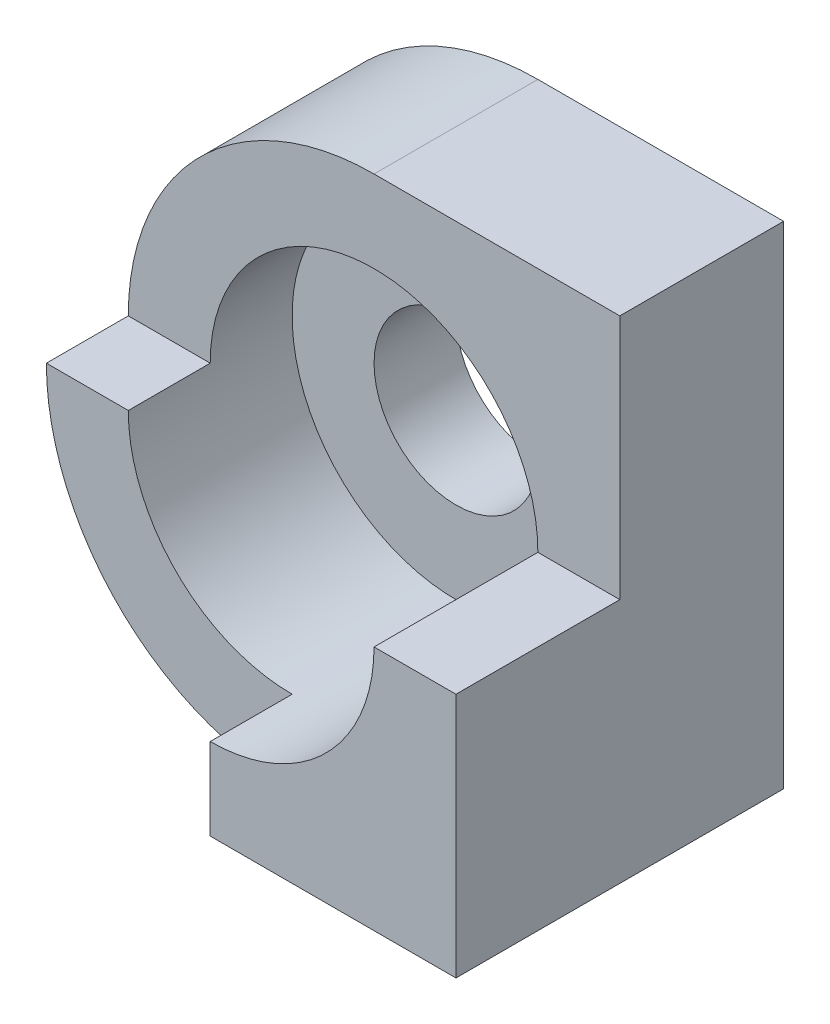
ISO-10303-21;
HEADER;
FILE_DESCRIPTION(('STEP AP214'),'2;1');
FILE_NAME('part.step','',(''),(''),'','','');
FILE_SCHEMA(('AUTOMOTIVE_DESIGN { 1 0 10303 214 1 1 1 1 }'));
ENDSEC;
DATA;
#1=APPLICATION_CONTEXT('core data for automotive mechanical design processes');
#2=APPLICATION_PROTOCOL_DEFINITION('international standard','automotive_design',2000,#1);
#3=PRODUCT_CONTEXT('',#1,'mechanical');
#4=PRODUCT('Part','Part','',(#3));
#5=PRODUCT_RELATED_PRODUCT_CATEGORY('part','',(#4));
#6=PRODUCT_DEFINITION_FORMATION('','',#4);
#7=PRODUCT_DEFINITION_CONTEXT('part definition',#1,'design');
#8=PRODUCT_DEFINITION('design','',#6,#7);
#9=PRODUCT_DEFINITION_SHAPE('','',#8);
#10=(LENGTH_UNIT() NAMED_UNIT(*) SI_UNIT(.MILLI.,.METRE.));
#11=(NAMED_UNIT(*) PLANE_ANGLE_UNIT() SI_UNIT($,.RADIAN.));
#12=(NAMED_UNIT(*) SI_UNIT($,.STERADIAN.) SOLID_ANGLE_UNIT());
#13=UNCERTAINTY_MEASURE_WITH_UNIT(LENGTH_MEASURE(1.E-05),#10,'distance_accuracy_value','');
#14=(GEOMETRIC_REPRESENTATION_CONTEXT(3) GLOBAL_UNCERTAINTY_ASSIGNED_CONTEXT((#13)) GLOBAL_UNIT_ASSIGNED_CONTEXT((#10,
#11,#12)) REPRESENTATION_CONTEXT('',''));
#15=CARTESIAN_POINT('',(0.,0.,0.));
#16=DIRECTION('',(0.,0.,1.));
#17=DIRECTION('',(1.,0.,0.));
#18=AXIS2_PLACEMENT_3D('',#15,#16,#17);
#19=CARTESIAN_POINT('',(0.,0.,2.));
#20=DIRECTION('',(0.,0.,1.));
#21=DIRECTION('',(1.,0.,0.));
#22=AXIS2_PLACEMENT_3D('',#19,#20,#21);
#23=PLANE('',#22);
#24=CARTESIAN_POINT('',(0.,0.,2.));
#25=DIRECTION('',(0.,0.,1.));
#26=DIRECTION('',(1.,0.,0.));
#27=AXIS2_PLACEMENT_3D('',#24,#25,#26);
#28=CIRCLE('',#27,3.);
#29=CARTESIAN_POINT('',(0.,3.,2.));
#30=VERTEX_POINT('',#29);
#31=CARTESIAN_POINT('',(-3.,0.,2.));
#32=VERTEX_POINT('',#31);
#33=EDGE_CURVE('E49',#30,#32,#28,.T.);
#34=ORIENTED_EDGE('',*,*,#33,.T.);
#35=DIRECTION('',(-1.,0.,0.));
#36=VECTOR('',#35,1.);
#37=CARTESIAN_POINT('',(-3.,0.,2.));
#38=LINE('',#37,#36);
#39=CARTESIAN_POINT('',(-2.,0.,2.));
#40=VERTEX_POINT('',#39);
#41=EDGE_CURVE('E53',#40,#32,#38,.T.);
#42=ORIENTED_EDGE('',*,*,#41,.F.);
#43=CARTESIAN_POINT('',(0.,0.,2.));
#44=DIRECTION('',(0.,0.,1.));
#45=DIRECTION('',(1.,0.,0.));
#46=AXIS2_PLACEMENT_3D('',#43,#44,#45);
#47=CIRCLE('',#46,2.);
#48=CARTESIAN_POINT('',(2.,0.,2.));
#49=VERTEX_POINT('',#48);
#50=EDGE_CURVE('E130',#49,#40,#47,.T.);
#51=ORIENTED_EDGE('',*,*,#50,.F.);
#52=DIRECTION('',(-1.,0.,0.));
#53=VECTOR('',#52,1.);
#54=CARTESIAN_POINT('',(3.,0.,2.));
#55=LINE('',#54,#53);
#56=CARTESIAN_POINT('',(3.,0.,2.));
#57=VERTEX_POINT('',#56);
#58=EDGE_CURVE('E131',#57,#49,#55,.T.);
#59=ORIENTED_EDGE('',*,*,#58,.F.);
#60=DIRECTION('',(0.,1.,0.));
#61=VECTOR('',#60,1.);
#62=CARTESIAN_POINT('',(3.,0.,2.));
#63=LINE('',#62,#61);
#64=CARTESIAN_POINT('',(3.,3.,2.));
#65=VERTEX_POINT('',#64);
#66=EDGE_CURVE('E168',#57,#65,#63,.T.);
#67=ORIENTED_EDGE('',*,*,#66,.T.);
#68=DIRECTION('',(-1.,0.,0.));
#69=VECTOR('',#68,1.);
#70=CARTESIAN_POINT('',(3.,3.,2.));
#71=LINE('',#70,#69);
#72=EDGE_CURVE('E170',#65,#30,#71,.T.);
#73=ORIENTED_EDGE('',*,*,#72,.T.);
#74=EDGE_LOOP('',(#34,#42,#51,#59,#67,#73));
#75=FACE_BOUND('',#74,.T.);
#76=ADVANCED_FACE('F33',(#75),#23,.T.);
#77=CARTESIAN_POINT('',(0.,-2.,4.));
#78=DIRECTION('',(1.,0.,0.));
#79=DIRECTION('',(0.,1.,0.));
#80=AXIS2_PLACEMENT_3D('',#77,#78,#79);
#81=PLANE('',#80);
#82=DIRECTION('',(0.,1.,0.));
#83=VECTOR('',#82,1.);
#84=CARTESIAN_POINT('',(0.,-2.,3.));
#85=LINE('',#84,#83);
#86=CARTESIAN_POINT('',(0.,-3.,3.));
#87=VERTEX_POINT('',#86);
#88=CARTESIAN_POINT('',(0.,-2.,3.));
#89=VERTEX_POINT('',#88);
#90=EDGE_CURVE('E123',#87,#89,#85,.T.);
#91=ORIENTED_EDGE('',*,*,#90,.F.);
#92=DIRECTION('',(0.,0.,-1.));
#93=VECTOR('',#92,1.);
#94=CARTESIAN_POINT('',(0.,-3.,4.));
#95=LINE('',#94,#93);
#96=CARTESIAN_POINT('',(0.,-3.,4.));
#97=VERTEX_POINT('',#96);
#98=EDGE_CURVE('E155',#97,#87,#95,.T.);
#99=ORIENTED_EDGE('',*,*,#98,.F.);
#100=DIRECTION('',(0.,-1.,0.));
#101=VECTOR('',#100,1.);
#102=CARTESIAN_POINT('',(0.,-2.,4.));
#103=LINE('',#102,#101);
#104=CARTESIAN_POINT('',(0.,-2.,4.));
#105=VERTEX_POINT('',#104);
#106=EDGE_CURVE('E141',#105,#97,#103,.T.);
#107=ORIENTED_EDGE('',*,*,#106,.F.);
#108=DIRECTION('',(0.,0.,-1.));
#109=VECTOR('',#108,1.);
#110=CARTESIAN_POINT('',(0.,-2.,4.));
#111=LINE('',#110,#109);
#112=EDGE_CURVE('E158',#105,#89,#111,.T.);
#113=ORIENTED_EDGE('',*,*,#112,.T.);
#114=EDGE_LOOP('',(#91,#99,#107,#113));
#115=FACE_BOUND('',#114,.T.);
#116=ADVANCED_FACE('F215',(#115),#81,.F.);
#117=CARTESIAN_POINT('',(0.,0.,2.));
#118=DIRECTION('',(0.,0.,-1.));
#119=DIRECTION('',(-1.,0.,0.));
#120=AXIS2_PLACEMENT_3D('',#117,#118,#119);
#121=CYLINDRICAL_SURFACE('',#120,1.);
#122=CARTESIAN_POINT('',(0.,0.,0.));
#123=DIRECTION('',(0.,0.,1.));
#124=DIRECTION('',(1.,0.,0.));
#125=AXIS2_PLACEMENT_3D('',#122,#123,#124);
#126=CIRCLE('',#125,1.);
#127=CARTESIAN_POINT('',(1.,0.,0.));
#128=VERTEX_POINT('',#127);
#129=EDGE_CURVE('E164',#128,#128,#126,.T.);
#130=ORIENTED_EDGE('',*,*,#129,.F.);
#131=EDGE_LOOP('',(#130));
#132=FACE_BOUND('',#131,.T.);
#133=CARTESIAN_POINT('',(0.,0.,1.));
#134=DIRECTION('',(0.,0.,1.));
#135=DIRECTION('',(1.,0.,0.));
#136=AXIS2_PLACEMENT_3D('',#133,#134,#135);
#137=CIRCLE('',#136,1.);
#138=CARTESIAN_POINT('',(1.,0.,1.));
#139=VERTEX_POINT('',#138);
#140=EDGE_CURVE('E37',#139,#139,#137,.T.);
#141=ORIENTED_EDGE('',*,*,#140,.T.);
#142=EDGE_LOOP('',(#141));
#143=FACE_BOUND('',#142,.T.);
#144=ADVANCED_FACE('F231',(#132,#143),#121,.F.);
#145=CARTESIAN_POINT('',(0.,0.,0.));
#146=DIRECTION('',(0.,0.,1.));
#147=DIRECTION('',(1.,0.,0.));
#148=AXIS2_PLACEMENT_3D('',#145,#146,#147);
#149=PLANE('',#148);
#150=DIRECTION('',(0.,1.,0.));
#151=VECTOR('',#150,1.);
#152=CARTESIAN_POINT('',(3.,0.,0.));
#153=LINE('',#152,#151);
#154=CARTESIAN_POINT('',(3.,-3.,0.));
#155=VERTEX_POINT('',#154);
#156=CARTESIAN_POINT('',(3.,3.,0.));
#157=VERTEX_POINT('',#156);
#158=EDGE_CURVE('E167',#155,#157,#153,.T.);
#159=ORIENTED_EDGE('',*,*,#158,.F.);
#160=DIRECTION('',(1.,0.,0.));
#161=VECTOR('',#160,1.);
#162=CARTESIAN_POINT('',(3.,-3.,0.));
#163=LINE('',#162,#161);
#164=CARTESIAN_POINT('',(0.,-3.,0.));
#165=VERTEX_POINT('',#164);
#166=EDGE_CURVE('E171',#165,#155,#163,.T.);
#167=ORIENTED_EDGE('',*,*,#166,.F.);
#168=CARTESIAN_POINT('',(0.,0.,0.));
#169=DIRECTION('',(0.,0.,1.));
#170=DIRECTION('',(1.,0.,0.));
#171=AXIS2_PLACEMENT_3D('',#168,#169,#170);
#172=CIRCLE('',#171,3.);
#173=CARTESIAN_POINT('',(0.,3.,0.));
#174=VERTEX_POINT('',#173);
#175=EDGE_CURVE('E178',#174,#165,#172,.T.);
#176=ORIENTED_EDGE('',*,*,#175,.F.);
#177=DIRECTION('',(-1.,0.,0.));
#178=VECTOR('',#177,1.);
#179=CARTESIAN_POINT('',(3.,3.,0.));
#180=LINE('',#179,#178);
#181=EDGE_CURVE('E176',#157,#174,#180,.T.);
#182=ORIENTED_EDGE('',*,*,#181,.F.);
#183=EDGE_LOOP('',(#159,#167,#176,#182));
#184=FACE_BOUND('',#183,.T.);
#185=ORIENTED_EDGE('',*,*,#129,.T.);
#186=EDGE_LOOP('',(#185));
#187=FACE_BOUND('',#186,.T.);
#188=ADVANCED_FACE('F197',(#184,#187),#149,.F.);
#189=CARTESIAN_POINT('',(3.,0.,2.));
#190=DIRECTION('',(-1.,0.,0.));
#191=DIRECTION('',(0.,0.,1.));
#192=AXIS2_PLACEMENT_3D('',#189,#190,#191);
#193=PLANE('',#192);
#194=ORIENTED_EDGE('',*,*,#158,.T.);
#195=DIRECTION('',(0.,0.,-1.));
#196=VECTOR('',#195,1.);
#197=CARTESIAN_POINT('',(3.,3.,2.));
#198=LINE('',#197,#196);
#199=EDGE_CURVE('E11',#65,#157,#198,.T.);
#200=ORIENTED_EDGE('',*,*,#199,.F.);
#201=ORIENTED_EDGE('',*,*,#66,.F.);
#202=DIRECTION('',(0.,0.,-1.));
#203=VECTOR('',#202,1.);
#204=CARTESIAN_POINT('',(3.,0.,4.));
#205=LINE('',#204,#203);
#206=CARTESIAN_POINT('',(3.,0.,4.));
#207=VERTEX_POINT('',#206);
#208=EDGE_CURVE('E152',#207,#57,#205,.T.);
#209=ORIENTED_EDGE('',*,*,#208,.F.);
#210=DIRECTION('',(0.,1.,0.));
#211=VECTOR('',#210,1.);
#212=CARTESIAN_POINT('',(3.,-3.,4.));
#213=LINE('',#212,#211);
#214=CARTESIAN_POINT('',(3.,-3.,4.));
#215=VERTEX_POINT('',#214);
#216=EDGE_CURVE('E146',#215,#207,#213,.T.);
#217=ORIENTED_EDGE('',*,*,#216,.F.);
#218=DIRECTION('',(0.,0.,-1.));
#219=VECTOR('',#218,1.);
#220=CARTESIAN_POINT('',(3.,-3.,2.));
#221=LINE('',#220,#219);
#222=EDGE_CURVE('E174',#215,#155,#221,.T.);
#223=ORIENTED_EDGE('',*,*,#222,.T.);
#224=EDGE_LOOP('',(#194,#200,#201,#209,#217,#223));
#225=FACE_BOUND('',#224,.T.);
#226=ADVANCED_FACE('F35',(#225),#193,.F.);
#227=CARTESIAN_POINT('',(3.,3.,2.));
#228=DIRECTION('',(0.,-1.,0.));
#229=DIRECTION('',(0.,0.,-1.));
#230=AXIS2_PLACEMENT_3D('',#227,#228,#229);
#231=PLANE('',#230);
#232=ORIENTED_EDGE('',*,*,#181,.T.);
#233=DIRECTION('',(0.,0.,-1.));
#234=VECTOR('',#233,1.);
#235=CARTESIAN_POINT('',(0.,3.,2.));
#236=LINE('',#235,#234);
#237=EDGE_CURVE('E42',#30,#174,#236,.T.);
#238=ORIENTED_EDGE('',*,*,#237,.F.);
#239=ORIENTED_EDGE('',*,*,#72,.F.);
#240=ORIENTED_EDGE('',*,*,#199,.T.);
#241=EDGE_LOOP('',(#232,#238,#239,#240));
#242=FACE_BOUND('',#241,.T.);
#243=ADVANCED_FACE('F219',(#242),#231,.F.);
#244=CARTESIAN_POINT('',(0.,0.,2.));
#245=DIRECTION('',(0.,0.,-1.));
#246=DIRECTION('',(-1.,0.,0.));
#247=AXIS2_PLACEMENT_3D('',#244,#245,#246);
#248=CYLINDRICAL_SURFACE('',#247,3.);
#249=ORIENTED_EDGE('',*,*,#175,.T.);
#250=DIRECTION('',(0.,0.,-1.));
#251=VECTOR('',#250,1.);
#252=CARTESIAN_POINT('',(0.,-3.,2.));
#253=LINE('',#252,#251);
#254=EDGE_CURVE('E184',#87,#165,#253,.T.);
#255=ORIENTED_EDGE('',*,*,#254,.F.);
#256=CARTESIAN_POINT('',(0.,0.,3.));
#257=DIRECTION('',(0.,0.,1.));
#258=DIRECTION('',(-1.,0.,0.));
#259=AXIS2_PLACEMENT_3D('',#256,#257,#258);
#260=CIRCLE('',#259,3.00000000000001);
#261=CARTESIAN_POINT('',(-3.,0.,3.));
#262=VERTEX_POINT('',#261);
#263=EDGE_CURVE('E116',#262,#87,#260,.T.);
#264=ORIENTED_EDGE('',*,*,#263,.F.);
#265=DIRECTION('',(0.,0.,-1.));
#266=VECTOR('',#265,1.);
#267=CARTESIAN_POINT('',(-3.,0.,3.));
#268=LINE('',#267,#266);
#269=EDGE_CURVE('E112',#262,#32,#268,.T.);
#270=ORIENTED_EDGE('',*,*,#269,.T.);
#271=ORIENTED_EDGE('',*,*,#33,.F.);
#272=ORIENTED_EDGE('',*,*,#237,.T.);
#273=EDGE_LOOP('',(#249,#255,#264,#270,#271,#272));
#274=FACE_BOUND('',#273,.T.);
#275=ADVANCED_FACE('F191',(#274),#248,.T.);
#276=CARTESIAN_POINT('',(3.,-3.,2.));
#277=DIRECTION('',(0.,1.,0.));
#278=DIRECTION('',(-1.,0.,0.));
#279=AXIS2_PLACEMENT_3D('',#276,#277,#278);
#280=PLANE('',#279);
#281=ORIENTED_EDGE('',*,*,#166,.T.);
#282=ORIENTED_EDGE('',*,*,#222,.F.);
#283=DIRECTION('',(1.,0.,0.));
#284=VECTOR('',#283,1.);
#285=CARTESIAN_POINT('',(0.,-3.,4.));
#286=LINE('',#285,#284);
#287=EDGE_CURVE('E143',#97,#215,#286,.T.);
#288=ORIENTED_EDGE('',*,*,#287,.F.);
#289=ORIENTED_EDGE('',*,*,#98,.T.);
#290=ORIENTED_EDGE('',*,*,#254,.T.);
#291=EDGE_LOOP('',(#281,#282,#288,#289,#290));
#292=FACE_BOUND('',#291,.T.);
#293=ADVANCED_FACE('F200',(#292),#280,.F.);
#294=CARTESIAN_POINT('',(0.,0.,1.));
#295=DIRECTION('',(0.,0.,1.));
#296=DIRECTION('',(1.,0.,0.));
#297=AXIS2_PLACEMENT_3D('',#294,#295,#296);
#298=CYLINDRICAL_SURFACE('',#297,2.);
#299=ORIENTED_EDGE('',*,*,#50,.T.);
#300=DIRECTION('',(0.,0.,-1.));
#301=VECTOR('',#300,1.);
#302=CARTESIAN_POINT('',(-2.,0.,3.));
#303=LINE('',#302,#301);
#304=CARTESIAN_POINT('',(-2.,0.,3.));
#305=VERTEX_POINT('',#304);
#306=EDGE_CURVE('E110',#305,#40,#303,.T.);
#307=ORIENTED_EDGE('',*,*,#306,.F.);
#308=CARTESIAN_POINT('',(0.,0.,3.));
#309=DIRECTION('',(0.,0.,-1.));
#310=DIRECTION('',(-1.,0.,0.));
#311=AXIS2_PLACEMENT_3D('',#308,#309,#310);
#312=CIRCLE('',#311,2.);
#313=EDGE_CURVE('E117',#89,#305,#312,.T.);
#314=ORIENTED_EDGE('',*,*,#313,.F.);
#315=ORIENTED_EDGE('',*,*,#112,.F.);
#316=CARTESIAN_POINT('',(0.,0.,4.));
#317=DIRECTION('',(0.,0.,-1.));
#318=DIRECTION('',(-1.,0.,0.));
#319=AXIS2_PLACEMENT_3D('',#316,#317,#318);
#320=CIRCLE('',#319,2.);
#321=CARTESIAN_POINT('',(2.,0.,4.));
#322=VERTEX_POINT('',#321);
#323=EDGE_CURVE('E134',#322,#105,#320,.T.);
#324=ORIENTED_EDGE('',*,*,#323,.F.);
#325=DIRECTION('',(0.,0.,-1.));
#326=VECTOR('',#325,1.);
#327=CARTESIAN_POINT('',(2.,0.,4.));
#328=LINE('',#327,#326);
#329=EDGE_CURVE('E149',#322,#49,#328,.T.);
#330=ORIENTED_EDGE('',*,*,#329,.T.);
#331=EDGE_LOOP('',(#299,#307,#314,#315,#324,#330));
#332=FACE_BOUND('',#331,.T.);
#333=CARTESIAN_POINT('',(0.,0.,1.));
#334=DIRECTION('',(0.,0.,1.));
#335=DIRECTION('',(1.,0.,0.));
#336=AXIS2_PLACEMENT_3D('',#333,#334,#335);
#337=CIRCLE('',#336,2.);
#338=CARTESIAN_POINT('',(2.,0.,1.));
#339=VERTEX_POINT('',#338);
#340=EDGE_CURVE('E160',#339,#339,#337,.T.);
#341=ORIENTED_EDGE('',*,*,#340,.F.);
#342=EDGE_LOOP('',(#341));
#343=FACE_BOUND('',#342,.T.);
#344=ADVANCED_FACE('F127',(#332,#343),#298,.F.);
#345=CARTESIAN_POINT('',(0.,0.,1.));
#346=DIRECTION('',(0.,0.,1.));
#347=DIRECTION('',(1.,0.,0.));
#348=AXIS2_PLACEMENT_3D('',#345,#346,#347);
#349=PLANE('',#348);
#350=ORIENTED_EDGE('',*,*,#140,.F.);
#351=EDGE_LOOP('',(#350));
#352=FACE_BOUND('',#351,.T.);
#353=ORIENTED_EDGE('',*,*,#340,.T.);
#354=EDGE_LOOP('',(#353));
#355=FACE_BOUND('',#354,.T.);
#356=ADVANCED_FACE('F242',(#352,#355),#349,.T.);
#357=CARTESIAN_POINT('',(3.,0.,4.));
#358=DIRECTION('',(0.,-1.,0.));
#359=DIRECTION('',(1.,0.,0.));
#360=AXIS2_PLACEMENT_3D('',#357,#358,#359);
#361=PLANE('',#360);
#362=ORIENTED_EDGE('',*,*,#58,.T.);
#363=ORIENTED_EDGE('',*,*,#329,.F.);
#364=DIRECTION('',(-1.,0.,0.));
#365=VECTOR('',#364,1.);
#366=CARTESIAN_POINT('',(3.,0.,4.));
#367=LINE('',#366,#365);
#368=EDGE_CURVE('E148',#207,#322,#367,.T.);
#369=ORIENTED_EDGE('',*,*,#368,.F.);
#370=ORIENTED_EDGE('',*,*,#208,.T.);
#371=EDGE_LOOP('',(#362,#363,#369,#370));
#372=FACE_BOUND('',#371,.T.);
#373=ADVANCED_FACE('F218',(#372),#361,.F.);
#374=CARTESIAN_POINT('',(0.,0.,4.));
#375=DIRECTION('',(0.,0.,-1.));
#376=DIRECTION('',(-1.,0.,0.));
#377=AXIS2_PLACEMENT_3D('',#374,#375,#376);
#378=PLANE('',#377);
#379=ORIENTED_EDGE('',*,*,#323,.T.);
#380=ORIENTED_EDGE('',*,*,#106,.T.);
#381=ORIENTED_EDGE('',*,*,#287,.T.);
#382=ORIENTED_EDGE('',*,*,#216,.T.);
#383=ORIENTED_EDGE('',*,*,#368,.T.);
#384=EDGE_LOOP('',(#379,#380,#381,#382,#383));
#385=FACE_BOUND('',#384,.T.);
#386=ADVANCED_FACE('F209',(#385),#378,.F.);
#387=CARTESIAN_POINT('',(-3.,0.,3.));
#388=DIRECTION('',(0.,-1.,0.));
#389=DIRECTION('',(1.,0.,0.));
#390=AXIS2_PLACEMENT_3D('',#387,#388,#389);
#391=PLANE('',#390);
#392=ORIENTED_EDGE('',*,*,#41,.T.);
#393=ORIENTED_EDGE('',*,*,#269,.F.);
#394=DIRECTION('',(-1.,0.,0.));
#395=VECTOR('',#394,1.);
#396=CARTESIAN_POINT('',(-3.,0.,3.));
#397=LINE('',#396,#395);
#398=EDGE_CURVE('E106',#305,#262,#397,.T.);
#399=ORIENTED_EDGE('',*,*,#398,.F.);
#400=ORIENTED_EDGE('',*,*,#306,.T.);
#401=EDGE_LOOP('',(#392,#393,#399,#400));
#402=FACE_BOUND('',#401,.T.);
#403=ADVANCED_FACE('F108',(#402),#391,.F.);
#404=CARTESIAN_POINT('',(0.,0.,3.));
#405=DIRECTION('',(0.,0.,-1.));
#406=DIRECTION('',(-1.,0.,0.));
#407=AXIS2_PLACEMENT_3D('',#404,#405,#406);
#408=PLANE('',#407);
#409=ORIENTED_EDGE('',*,*,#313,.T.);
#410=ORIENTED_EDGE('',*,*,#398,.T.);
#411=ORIENTED_EDGE('',*,*,#263,.T.);
#412=ORIENTED_EDGE('',*,*,#90,.T.);
#413=EDGE_LOOP('',(#409,#410,#411,#412));
#414=FACE_BOUND('',#413,.T.);
#415=ADVANCED_FACE('F121',(#414),#408,.F.);
#416=CLOSED_SHELL('',(#76,#116,#144,#188,#226,#243,#275,#293,#344,#356,#373,#386,#403,#415));
#417=MANIFOLD_SOLID_BREP('B2',#416);
#418=ADVANCED_BREP_SHAPE_REPRESENTATION('',(#18,#417),#14);
#419=SHAPE_DEFINITION_REPRESENTATION(#9,#418);
ENDSEC;
END-ISO-10303-21;
